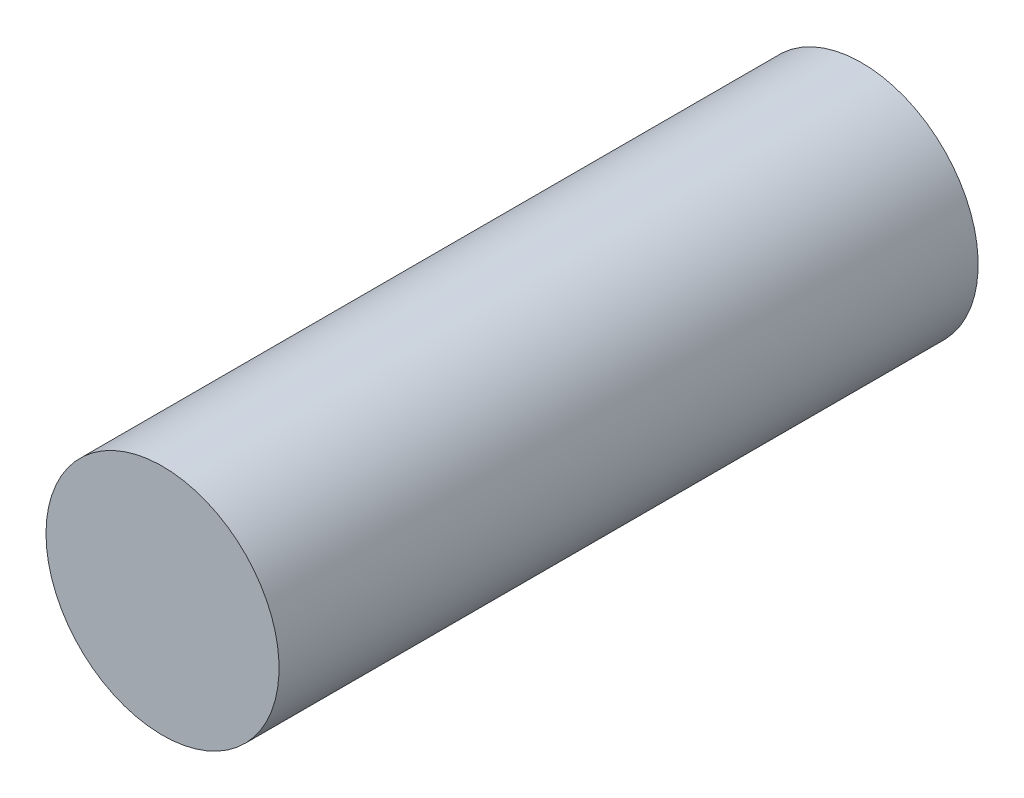
ISO-10303-21;
HEADER;
FILE_DESCRIPTION(('STEP AP214'),'2;1');
FILE_NAME('part.step','',(''),(''),'','','');
FILE_SCHEMA(('AUTOMOTIVE_DESIGN { 1 0 10303 214 1 1 1 1 }'));
ENDSEC;
DATA;
#1=APPLICATION_CONTEXT('core data for automotive mechanical design processes');
#2=APPLICATION_PROTOCOL_DEFINITION('international standard','automotive_design',2000,#1);
#3=PRODUCT_CONTEXT('',#1,'mechanical');
#4=PRODUCT('Part','Part','',(#3));
#5=PRODUCT_RELATED_PRODUCT_CATEGORY('part','',(#4));
#6=PRODUCT_DEFINITION_FORMATION('','',#4);
#7=PRODUCT_DEFINITION_CONTEXT('part definition',#1,'design');
#8=PRODUCT_DEFINITION('design','',#6,#7);
#9=PRODUCT_DEFINITION_SHAPE('','',#8);
#10=(LENGTH_UNIT() NAMED_UNIT(*) SI_UNIT(.MILLI.,.METRE.));
#11=(NAMED_UNIT(*) PLANE_ANGLE_UNIT() SI_UNIT($,.RADIAN.));
#12=(NAMED_UNIT(*) SI_UNIT($,.STERADIAN.) SOLID_ANGLE_UNIT());
#13=UNCERTAINTY_MEASURE_WITH_UNIT(LENGTH_MEASURE(1.E-05),#10,'distance_accuracy_value','');
#14=(GEOMETRIC_REPRESENTATION_CONTEXT(3) GLOBAL_UNCERTAINTY_ASSIGNED_CONTEXT((#13)) GLOBAL_UNIT_ASSIGNED_CONTEXT((#10,
#11,#12)) REPRESENTATION_CONTEXT('',''));
#15=CARTESIAN_POINT('',(0.,0.,0.));
#16=DIRECTION('',(0.,0.,1.));
#17=DIRECTION('',(1.,0.,0.));
#18=AXIS2_PLACEMENT_3D('',#15,#16,#17);
#19=CARTESIAN_POINT('',(0.,0.,9.525));
#20=DIRECTION('',(0.,0.,1.));
#21=DIRECTION('',(1.,0.,0.));
#22=AXIS2_PLACEMENT_3D('',#19,#20,#21);
#23=PLANE('',#22);
#24=CARTESIAN_POINT('',(0.,0.,9.525));
#25=DIRECTION('',(0.,0.,-1.));
#26=DIRECTION('',(-1.,0.,0.));
#27=AXIS2_PLACEMENT_3D('',#24,#25,#26);
#28=CIRCLE('',#27,3.175);
#29=CARTESIAN_POINT('',(-3.175,0.,9.525));
#30=VERTEX_POINT('',#29);
#31=EDGE_CURVE('E18',#30,#30,#28,.T.);
#32=ORIENTED_EDGE('',*,*,#31,.F.);
#33=EDGE_LOOP('',(#32));
#34=FACE_BOUND('',#33,.T.);
#35=ADVANCED_FACE('F15',(#34),#23,.T.);
#36=CARTESIAN_POINT('',(0.,0.,-9.525));
#37=DIRECTION('',(0.,0.,1.));
#38=DIRECTION('',(1.,0.,0.));
#39=AXIS2_PLACEMENT_3D('',#36,#37,#38);
#40=PLANE('',#39);
#41=CARTESIAN_POINT('',(0.,0.,-9.525));
#42=DIRECTION('',(0.,0.,-1.));
#43=DIRECTION('',(-1.,0.,0.));
#44=AXIS2_PLACEMENT_3D('',#41,#42,#43);
#45=CIRCLE('',#44,3.175);
#46=CARTESIAN_POINT('',(-3.175,0.,-9.525));
#47=VERTEX_POINT('',#46);
#48=EDGE_CURVE('E10',#47,#47,#45,.F.);
#49=ORIENTED_EDGE('',*,*,#48,.F.);
#50=EDGE_LOOP('',(#49));
#51=FACE_BOUND('',#50,.T.);
#52=ADVANCED_FACE('F30',(#51),#40,.F.);
#53=CARTESIAN_POINT('',(0.,0.,9.525));
#54=DIRECTION('',(0.,0.,-1.));
#55=DIRECTION('',(-1.,0.,0.));
#56=AXIS2_PLACEMENT_3D('',#53,#54,#55);
#57=CYLINDRICAL_SURFACE('',#56,3.175);
#58=ORIENTED_EDGE('',*,*,#48,.T.);
#59=EDGE_LOOP('',(#58));
#60=FACE_BOUND('',#59,.T.);
#61=ORIENTED_EDGE('',*,*,#31,.T.);
#62=EDGE_LOOP('',(#61));
#63=FACE_BOUND('',#62,.T.);
#64=ADVANCED_FACE('F27',(#60,#63),#57,.T.);
#65=CLOSED_SHELL('',(#35,#52,#64));
#66=MANIFOLD_SOLID_BREP('B1',#65);
#67=ADVANCED_BREP_SHAPE_REPRESENTATION('',(#18,#66),#14);
#68=SHAPE_DEFINITION_REPRESENTATION(#9,#67);
ENDSEC;
END-ISO-10303-21;
